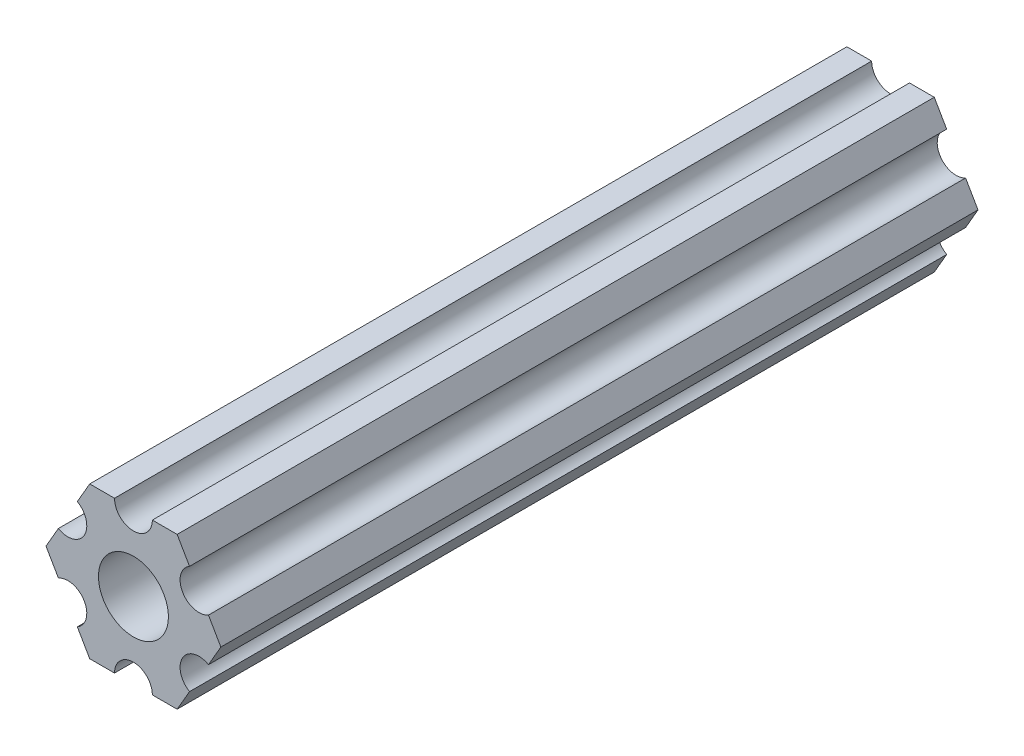
ISO-10303-21;
HEADER;
FILE_DESCRIPTION(('STEP AP214'),'2;1');
FILE_NAME('part.step','',(''),(''),'','','');
FILE_SCHEMA(('AUTOMOTIVE_DESIGN { 1 0 10303 214 1 1 1 1 }'));
ENDSEC;
DATA;
#1=APPLICATION_CONTEXT('core data for automotive mechanical design processes');
#2=APPLICATION_PROTOCOL_DEFINITION('international standard','automotive_design',2000,#1);
#3=PRODUCT_CONTEXT('',#1,'mechanical');
#4=PRODUCT('Part','Part','',(#3));
#5=PRODUCT_RELATED_PRODUCT_CATEGORY('part','',(#4));
#6=PRODUCT_DEFINITION_FORMATION('','',#4);
#7=PRODUCT_DEFINITION_CONTEXT('part definition',#1,'design');
#8=PRODUCT_DEFINITION('design','',#6,#7);
#9=PRODUCT_DEFINITION_SHAPE('','',#8);
#10=(LENGTH_UNIT() NAMED_UNIT(*) SI_UNIT(.MILLI.,.METRE.));
#11=(NAMED_UNIT(*) PLANE_ANGLE_UNIT() SI_UNIT($,.RADIAN.));
#12=(NAMED_UNIT(*) SI_UNIT($,.STERADIAN.) SOLID_ANGLE_UNIT());
#13=UNCERTAINTY_MEASURE_WITH_UNIT(LENGTH_MEASURE(1.E-05),#10,'distance_accuracy_value','');
#14=(GEOMETRIC_REPRESENTATION_CONTEXT(3) GLOBAL_UNCERTAINTY_ASSIGNED_CONTEXT((#13)) GLOBAL_UNIT_ASSIGNED_CONTEXT((#10,
#11,#12)) REPRESENTATION_CONTEXT('',''));
#15=CARTESIAN_POINT('',(0.,0.,0.));
#16=DIRECTION('',(0.,0.,1.));
#17=DIRECTION('',(1.,0.,0.));
#18=AXIS2_PLACEMENT_3D('',#15,#16,#17);
#19=CARTESIAN_POINT('',(6.29301120497139,1.80018505273894,63.5));
#20=DIRECTION('',(0.866025373493143,0.500000052466059,0.));
#21=DIRECTION('',(-0.500000052466059,0.866025373493143,0.));
#22=AXIS2_PLACEMENT_3D('',#19,#20,#21);
#23=PLANE('',#22);
#24=DIRECTION('',(0.500000052466059,-0.866025373493143,0.));
#25=VECTOR('',#24,1.);
#26=CARTESIAN_POINT('',(6.29301120497139,1.80018505273894,0.));
#27=LINE('',#26,#25);
#28=CARTESIAN_POINT('',(6.29301120497139,1.80018505273894,0.));
#29=VERTEX_POINT('',#28);
#30=CARTESIAN_POINT('',(7.33234841870827,4.44212519169686E-07,0.));
#31=VERTEX_POINT('',#30);
#32=EDGE_CURVE('E190',#29,#31,#27,.T.);
#33=ORIENTED_EDGE('',*,*,#32,.F.);
#34=DIRECTION('',(0.,0.,-1.));
#35=VECTOR('',#34,1.);
#36=CARTESIAN_POINT('',(6.29301120497139,1.80018505273894,63.5));
#37=LINE('',#36,#35);
#38=CARTESIAN_POINT('',(6.29301120497139,1.80018505273894,63.5));
#39=VERTEX_POINT('',#38);
#40=EDGE_CURVE('E11',#39,#29,#37,.T.);
#41=ORIENTED_EDGE('',*,*,#40,.F.);
#42=DIRECTION('',(0.500000052466059,-0.866025373493143,0.));
#43=VECTOR('',#42,1.);
#44=CARTESIAN_POINT('',(6.29301120497139,1.80018505273894,63.5));
#45=LINE('',#44,#43);
#46=CARTESIAN_POINT('',(7.33234841870827,4.44212519169686E-07,63.5));
#47=VERTEX_POINT('',#46);
#48=EDGE_CURVE('E241',#39,#47,#45,.T.);
#49=ORIENTED_EDGE('',*,*,#48,.T.);
#50=DIRECTION('',(0.,0.,-1.));
#51=VECTOR('',#50,1.);
#52=CARTESIAN_POINT('',(7.33234841870827,4.44212519169686E-07,63.5));
#53=LINE('',#52,#51);
#54=EDGE_CURVE('E36',#47,#31,#53,.T.);
#55=ORIENTED_EDGE('',*,*,#54,.T.);
#56=EDGE_LOOP('',(#33,#41,#49,#55));
#57=FACE_BOUND('',#56,.T.);
#58=ADVANCED_FACE('F33',(#57),#23,.T.);
#59=CARTESIAN_POINT('',(5.49926112168152,3.17500033315931,63.5));
#60=DIRECTION('',(0.,0.,-1.));
#61=DIRECTION('',(-1.,0.,0.));
#62=AXIS2_PLACEMENT_3D('',#59,#60,#61);
#63=CYLINDRICAL_SURFACE('',#62,1.5875);
#64=CARTESIAN_POINT('',(5.49926112168152,3.17500033315931,0.));
#65=DIRECTION('',(0.,0.,1.));
#66=DIRECTION('',(1.,0.,0.));
#67=AXIS2_PLACEMENT_3D('',#64,#65,#66);
#68=CIRCLE('',#67,1.5875);
#69=CARTESIAN_POINT('',(4.70551103839165,4.54981561357968,0.));
#70=VERTEX_POINT('',#69);
#71=EDGE_CURVE('E239',#70,#29,#68,.T.);
#72=ORIENTED_EDGE('',*,*,#71,.F.);
#73=DIRECTION('',(0.,0.,-1.));
#74=VECTOR('',#73,1.);
#75=CARTESIAN_POINT('',(4.70551103839165,4.54981561357968,63.5));
#76=LINE('',#75,#74);
#77=CARTESIAN_POINT('',(4.70551103839165,4.54981561357968,63.5));
#78=VERTEX_POINT('',#77);
#79=EDGE_CURVE('E42',#78,#70,#76,.T.);
#80=ORIENTED_EDGE('',*,*,#79,.F.);
#81=CARTESIAN_POINT('',(5.49926112168152,3.17500033315931,63.5));
#82=DIRECTION('',(0.,0.,1.));
#83=DIRECTION('',(1.,0.,0.));
#84=AXIS2_PLACEMENT_3D('',#81,#82,#83);
#85=CIRCLE('',#84,1.5875);
#86=EDGE_CURVE('E180',#78,#39,#85,.T.);
#87=ORIENTED_EDGE('',*,*,#86,.T.);
#88=ORIENTED_EDGE('',*,*,#40,.T.);
#89=EDGE_LOOP('',(#72,#80,#87,#88));
#90=FACE_BOUND('',#89,.T.);
#91=ADVANCED_FACE('F273',(#90),#63,.F.);
#92=CARTESIAN_POINT('',(3.66617382465471,6.35000022210621,63.5));
#93=DIRECTION('',(0.866025373493144,0.500000052466059,0.));
#94=DIRECTION('',(-0.500000052466059,0.866025373493144,0.));
#95=AXIS2_PLACEMENT_3D('',#92,#93,#94);
#96=PLANE('',#95);
#97=DIRECTION('',(0.500000052466059,-0.866025373493143,0.));
#98=VECTOR('',#97,1.);
#99=CARTESIAN_POINT('',(3.66617382465471,6.35000022210621,0.));
#100=LINE('',#99,#98);
#101=CARTESIAN_POINT('',(3.66617382465471,6.35000022210621,0.));
#102=VERTEX_POINT('',#101);
#103=EDGE_CURVE('E167',#102,#70,#100,.T.);
#104=ORIENTED_EDGE('',*,*,#103,.F.);
#105=DIRECTION('',(0.,0.,-1.));
#106=VECTOR('',#105,1.);
#107=CARTESIAN_POINT('',(3.66617382465471,6.35000022210621,63.5));
#108=LINE('',#107,#106);
#109=CARTESIAN_POINT('',(3.66617382465471,6.35000022210621,63.5));
#110=VERTEX_POINT('',#109);
#111=EDGE_CURVE('E162',#110,#102,#108,.T.);
#112=ORIENTED_EDGE('',*,*,#111,.F.);
#113=DIRECTION('',(0.500000052466059,-0.866025373493143,0.));
#114=VECTOR('',#113,1.);
#115=CARTESIAN_POINT('',(3.66617382465471,6.35000022210621,63.5));
#116=LINE('',#115,#114);
#117=EDGE_CURVE('E165',#110,#78,#116,.T.);
#118=ORIENTED_EDGE('',*,*,#117,.T.);
#119=ORIENTED_EDGE('',*,*,#79,.T.);
#120=EDGE_LOOP('',(#104,#112,#118,#119));
#121=FACE_BOUND('',#120,.T.);
#122=ADVANCED_FACE('F164',(#121),#96,.T.);
#123=CARTESIAN_POINT('',(1.58749961530064,6.35000022210621,63.5));
#124=DIRECTION('',(0.,1.,0.));
#125=DIRECTION('',(-1.,0.,0.));
#126=AXIS2_PLACEMENT_3D('',#123,#124,#125);
#127=PLANE('',#126);
#128=DIRECTION('',(1.,0.,0.));
#129=VECTOR('',#128,1.);
#130=CARTESIAN_POINT('',(1.58749961530064,6.35000022210621,0.));
#131=LINE('',#130,#129);
#132=CARTESIAN_POINT('',(1.58749961530064,6.35000022210621,0.));
#133=VERTEX_POINT('',#132);
#134=EDGE_CURVE('E236',#133,#102,#131,.T.);
#135=ORIENTED_EDGE('',*,*,#134,.F.);
#136=DIRECTION('',(0.,0.,-1.));
#137=VECTOR('',#136,1.);
#138=CARTESIAN_POINT('',(1.58749961530064,6.35000022210621,63.5));
#139=LINE('',#138,#137);
#140=CARTESIAN_POINT('',(1.58749961530064,6.35000022210621,63.5));
#141=VERTEX_POINT('',#140);
#142=EDGE_CURVE('E172',#141,#133,#139,.T.);
#143=ORIENTED_EDGE('',*,*,#142,.F.);
#144=DIRECTION('',(1.,0.,0.));
#145=VECTOR('',#144,1.);
#146=CARTESIAN_POINT('',(1.58749961530064,6.35000022210621,63.5));
#147=LINE('',#146,#145);
#148=EDGE_CURVE('E178',#141,#110,#147,.T.);
#149=ORIENTED_EDGE('',*,*,#148,.T.);
#150=ORIENTED_EDGE('',*,*,#111,.T.);
#151=EDGE_LOOP('',(#135,#143,#149,#150));
#152=FACE_BOUND('',#151,.T.);
#153=ADVANCED_FACE('F182',(#152),#127,.T.);
#154=CARTESIAN_POINT('',(-3.84699364247082E-07,6.35000022210621,63.5));
#155=DIRECTION('',(0.,0.,-1.));
#156=DIRECTION('',(-1.,0.,0.));
#157=AXIS2_PLACEMENT_3D('',#154,#155,#156);
#158=CYLINDRICAL_SURFACE('',#157,1.5875);
#159=CARTESIAN_POINT('',(-3.84699364247082E-07,6.35000022210621,0.));
#160=DIRECTION('',(0.,0.,1.));
#161=DIRECTION('',(1.,0.,0.));
#162=AXIS2_PLACEMENT_3D('',#159,#160,#161);
#163=CIRCLE('',#162,1.5875);
#164=CARTESIAN_POINT('',(-1.58750038469937,6.35000022210621,0.));
#165=VERTEX_POINT('',#164);
#166=EDGE_CURVE('E233',#165,#133,#163,.T.);
#167=ORIENTED_EDGE('',*,*,#166,.F.);
#168=DIRECTION('',(0.,0.,-1.));
#169=VECTOR('',#168,1.);
#170=CARTESIAN_POINT('',(-1.58750038469937,6.35000022210621,63.5));
#171=LINE('',#170,#169);
#172=CARTESIAN_POINT('',(-1.58750038469937,6.35000022210621,63.5));
#173=VERTEX_POINT('',#172);
#174=EDGE_CURVE('E245',#173,#165,#171,.T.);
#175=ORIENTED_EDGE('',*,*,#174,.F.);
#176=CARTESIAN_POINT('',(-3.84699364247082E-07,6.35000022210621,63.5));
#177=DIRECTION('',(0.,0.,1.));
#178=DIRECTION('',(1.,0.,0.));
#179=AXIS2_PLACEMENT_3D('',#176,#177,#178);
#180=CIRCLE('',#179,1.5875);
#181=EDGE_CURVE('E183',#173,#141,#180,.T.);
#182=ORIENTED_EDGE('',*,*,#181,.T.);
#183=ORIENTED_EDGE('',*,*,#142,.T.);
#184=EDGE_LOOP('',(#167,#175,#182,#183));
#185=FACE_BOUND('',#184,.T.);
#186=ADVANCED_FACE('F286',(#185),#158,.F.);
#187=CARTESIAN_POINT('',(-3.6661745940536,6.35000022210621,63.5));
#188=DIRECTION('',(0.,1.,0.));
#189=DIRECTION('',(-1.,0.,0.));
#190=AXIS2_PLACEMENT_3D('',#187,#188,#189);
#191=PLANE('',#190);
#192=DIRECTION('',(1.,0.,0.));
#193=VECTOR('',#192,1.);
#194=CARTESIAN_POINT('',(-3.6661745940536,6.35000022210621,0.));
#195=LINE('',#194,#193);
#196=CARTESIAN_POINT('',(-3.6661745940536,6.35000022210621,0.));
#197=VERTEX_POINT('',#196);
#198=EDGE_CURVE('E230',#197,#165,#195,.T.);
#199=ORIENTED_EDGE('',*,*,#198,.F.);
#200=DIRECTION('',(0.,0.,-1.));
#201=VECTOR('',#200,1.);
#202=CARTESIAN_POINT('',(-3.6661745940536,6.35000022210621,63.5));
#203=LINE('',#202,#201);
#204=CARTESIAN_POINT('',(-3.6661745940536,6.35000022210621,63.5));
#205=VERTEX_POINT('',#204);
#206=EDGE_CURVE('E247',#205,#197,#203,.T.);
#207=ORIENTED_EDGE('',*,*,#206,.F.);
#208=DIRECTION('',(1.,0.,0.));
#209=VECTOR('',#208,1.);
#210=CARTESIAN_POINT('',(-3.6661745940536,6.35000022210621,63.5));
#211=LINE('',#210,#209);
#212=EDGE_CURVE('E185',#205,#173,#211,.T.);
#213=ORIENTED_EDGE('',*,*,#212,.T.);
#214=ORIENTED_EDGE('',*,*,#174,.T.);
#215=EDGE_LOOP('',(#199,#207,#213,#214));
#216=FACE_BOUND('',#215,.T.);
#217=ADVANCED_FACE('F289',(#216),#191,.T.);
#218=CARTESIAN_POINT('',(-4.70551143896598,4.5498156227453,63.5));
#219=DIRECTION('',(-0.866025449221372,0.499999921300914,0.));
#220=DIRECTION('',(-0.499999921300914,-0.866025449221372,0.));
#221=AXIS2_PLACEMENT_3D('',#218,#219,#220);
#222=PLANE('',#221);
#223=DIRECTION('',(0.499999921300914,0.866025449221372,0.));
#224=VECTOR('',#223,1.);
#225=CARTESIAN_POINT('',(-4.70551143896598,4.5498156227453,0.));
#226=LINE('',#225,#224);
#227=CARTESIAN_POINT('',(-4.70551143896598,4.5498156227453,0.));
#228=VERTEX_POINT('',#227);
#229=EDGE_CURVE('E227',#228,#197,#226,.T.);
#230=ORIENTED_EDGE('',*,*,#229,.F.);
#231=DIRECTION('',(0.,0.,-1.));
#232=VECTOR('',#231,1.);
#233=CARTESIAN_POINT('',(-4.70551143896598,4.5498156227453,63.5));
#234=LINE('',#233,#232);
#235=CARTESIAN_POINT('',(-4.70551143896598,4.5498156227453,63.5));
#236=VERTEX_POINT('',#235);
#237=EDGE_CURVE('E249',#236,#228,#234,.T.);
#238=ORIENTED_EDGE('',*,*,#237,.F.);
#239=DIRECTION('',(0.499999921300914,0.866025449221372,0.));
#240=VECTOR('',#239,1.);
#241=CARTESIAN_POINT('',(-4.70551143896598,4.5498156227453,63.5));
#242=LINE('',#241,#240);
#243=EDGE_CURVE('E394',#236,#205,#242,.T.);
#244=ORIENTED_EDGE('',*,*,#243,.T.);
#245=ORIENTED_EDGE('',*,*,#206,.T.);
#246=EDGE_LOOP('',(#230,#238,#244,#245));
#247=FACE_BOUND('',#246,.T.);
#248=ADVANCED_FACE('F293',(#247),#222,.T.);
#249=CARTESIAN_POINT('',(-5.49926131403118,3.17500022210637,63.5));
#250=DIRECTION('',(0.,0.,-1.));
#251=DIRECTION('',(-1.,0.,0.));
#252=AXIS2_PLACEMENT_3D('',#249,#250,#251);
#253=CYLINDRICAL_SURFACE('',#252,1.5875);
#254=CARTESIAN_POINT('',(-5.49926131403118,3.17500022210637,0.));
#255=DIRECTION('',(0.,0.,1.));
#256=DIRECTION('',(1.,0.,0.));
#257=AXIS2_PLACEMENT_3D('',#254,#255,#256);
#258=CIRCLE('',#257,1.5875);
#259=CARTESIAN_POINT('',(-6.29301118909638,1.80018482146744,0.));
#260=VERTEX_POINT('',#259);
#261=EDGE_CURVE('E224',#260,#228,#258,.T.);
#262=ORIENTED_EDGE('',*,*,#261,.F.);
#263=DIRECTION('',(0.,0.,-1.));
#264=VECTOR('',#263,1.);
#265=CARTESIAN_POINT('',(-6.29301118909638,1.80018482146744,63.5));
#266=LINE('',#265,#264);
#267=CARTESIAN_POINT('',(-6.29301118909638,1.80018482146744,63.5));
#268=VERTEX_POINT('',#267);
#269=EDGE_CURVE('E251',#268,#260,#266,.T.);
#270=ORIENTED_EDGE('',*,*,#269,.F.);
#271=CARTESIAN_POINT('',(-5.49926131403118,3.17500022210637,63.5));
#272=DIRECTION('',(0.,0.,1.));
#273=DIRECTION('',(1.,0.,0.));
#274=AXIS2_PLACEMENT_3D('',#271,#272,#273);
#275=CIRCLE('',#274,1.5875);
#276=EDGE_CURVE('E391',#268,#236,#275,.T.);
#277=ORIENTED_EDGE('',*,*,#276,.T.);
#278=ORIENTED_EDGE('',*,*,#237,.T.);
#279=EDGE_LOOP('',(#262,#270,#277,#278));
#280=FACE_BOUND('',#279,.T.);
#281=ADVANCED_FACE('F297',(#280),#253,.F.);
#282=CARTESIAN_POINT('',(-7.33234803400887,2.22106353521304E-07,63.5));
#283=DIRECTION('',(-0.866025449221373,0.499999921300913,0.));
#284=DIRECTION('',(-0.499999921300913,-0.866025449221373,0.));
#285=AXIS2_PLACEMENT_3D('',#282,#283,#284);
#286=PLANE('',#285);
#287=DIRECTION('',(0.499999921300913,0.866025449221373,0.));
#288=VECTOR('',#287,1.);
#289=CARTESIAN_POINT('',(-7.33234803400887,2.22106353521304E-07,0.));
#290=LINE('',#289,#288);
#291=CARTESIAN_POINT('',(-7.33234803400887,2.22106353521304E-07,0.));
#292=VERTEX_POINT('',#291);
#293=EDGE_CURVE('E221',#292,#260,#290,.T.);
#294=ORIENTED_EDGE('',*,*,#293,.F.);
#295=DIRECTION('',(0.,0.,-1.));
#296=VECTOR('',#295,1.);
#297=CARTESIAN_POINT('',(-7.33234803400887,2.22106353521304E-07,63.5));
#298=LINE('',#297,#296);
#299=CARTESIAN_POINT('',(-7.33234803400887,2.22106353521304E-07,63.5));
#300=VERTEX_POINT('',#299);
#301=EDGE_CURVE('E253',#300,#292,#298,.T.);
#302=ORIENTED_EDGE('',*,*,#301,.F.);
#303=DIRECTION('',(0.499999921300913,0.866025449221373,0.));
#304=VECTOR('',#303,1.);
#305=CARTESIAN_POINT('',(-7.33234803400887,2.22106353521304E-07,63.5));
#306=LINE('',#305,#304);
#307=EDGE_CURVE('E388',#300,#268,#306,.T.);
#308=ORIENTED_EDGE('',*,*,#307,.T.);
#309=ORIENTED_EDGE('',*,*,#269,.T.);
#310=EDGE_LOOP('',(#294,#302,#308,#309));
#311=FACE_BOUND('',#310,.T.);
#312=ADVANCED_FACE('F301',(#311),#286,.T.);
#313=CARTESIAN_POINT('',(-6.29301092933186,-1.80018444938582,63.5));
#314=DIRECTION('',(-0.866025403784447,-0.499999999999985,0.));
#315=DIRECTION('',(0.499999999999985,-0.866025403784447,0.));
#316=AXIS2_PLACEMENT_3D('',#313,#314,#315);
#317=PLANE('',#316);
#318=DIRECTION('',(-0.499999999999985,0.866025403784447,0.));
#319=VECTOR('',#318,1.);
#320=CARTESIAN_POINT('',(-6.29301092933186,-1.80018444938582,0.));
#321=LINE('',#320,#319);
#322=CARTESIAN_POINT('',(-6.29301092933186,-1.80018444938582,0.));
#323=VERTEX_POINT('',#322);
#324=EDGE_CURVE('E218',#323,#292,#321,.T.);
#325=ORIENTED_EDGE('',*,*,#324,.F.);
#326=DIRECTION('',(0.,0.,-1.));
#327=VECTOR('',#326,1.);
#328=CARTESIAN_POINT('',(-6.29301092933186,-1.80018444938582,63.5));
#329=LINE('',#328,#327);
#330=CARTESIAN_POINT('',(-6.29301092933186,-1.80018444938582,63.5));
#331=VERTEX_POINT('',#330);
#332=EDGE_CURVE('E255',#331,#323,#329,.T.);
#333=ORIENTED_EDGE('',*,*,#332,.F.);
#334=DIRECTION('',(-0.499999999999985,0.866025403784447,0.));
#335=VECTOR('',#334,1.);
#336=CARTESIAN_POINT('',(-6.29301092933186,-1.80018444938582,63.5));
#337=LINE('',#336,#335);
#338=EDGE_CURVE('E385',#331,#300,#337,.T.);
#339=ORIENTED_EDGE('',*,*,#338,.T.);
#340=ORIENTED_EDGE('',*,*,#301,.T.);
#341=EDGE_LOOP('',(#325,#333,#339,#340));
#342=FACE_BOUND('',#341,.T.);
#343=ADVANCED_FACE('F305',(#342),#317,.T.);
#344=CARTESIAN_POINT('',(-5.49926092933189,-3.17499977789363,63.5));
#345=DIRECTION('',(0.,0.,-1.));
#346=DIRECTION('',(-1.,0.,0.));
#347=AXIS2_PLACEMENT_3D('',#344,#345,#346);
#348=CYLINDRICAL_SURFACE('',#347,1.5875);
#349=CARTESIAN_POINT('',(-5.49926092933189,-3.17499977789363,0.));
#350=DIRECTION('',(0.,0.,1.));
#351=DIRECTION('',(1.,0.,0.));
#352=AXIS2_PLACEMENT_3D('',#349,#350,#351);
#353=CIRCLE('',#352,1.5875);
#354=CARTESIAN_POINT('',(-4.70551092933191,-4.54981510640144,0.));
#355=VERTEX_POINT('',#354);
#356=EDGE_CURVE('E215',#355,#323,#353,.T.);
#357=ORIENTED_EDGE('',*,*,#356,.F.);
#358=DIRECTION('',(0.,0.,-1.));
#359=VECTOR('',#358,1.);
#360=CARTESIAN_POINT('',(-4.70551092933191,-4.54981510640144,63.5));
#361=LINE('',#360,#359);
#362=CARTESIAN_POINT('',(-4.70551092933191,-4.54981510640144,63.5));
#363=VERTEX_POINT('',#362);
#364=EDGE_CURVE('E257',#363,#355,#361,.T.);
#365=ORIENTED_EDGE('',*,*,#364,.F.);
#366=CARTESIAN_POINT('',(-5.49926092933189,-3.17499977789363,63.5));
#367=DIRECTION('',(0.,0.,1.));
#368=DIRECTION('',(1.,0.,0.));
#369=AXIS2_PLACEMENT_3D('',#366,#367,#368);
#370=CIRCLE('',#369,1.5875);
#371=EDGE_CURVE('E382',#363,#331,#370,.T.);
#372=ORIENTED_EDGE('',*,*,#371,.T.);
#373=ORIENTED_EDGE('',*,*,#332,.T.);
#374=EDGE_LOOP('',(#357,#365,#372,#373));
#375=FACE_BOUND('',#374,.T.);
#376=ADVANCED_FACE('F309',(#375),#348,.F.);
#377=CARTESIAN_POINT('',(-3.66617382465484,-6.34999977789374,63.5));
#378=DIRECTION('',(-0.866025403784447,-0.499999999999985,0.));
#379=DIRECTION('',(0.499999999999985,-0.866025403784447,0.));
#380=AXIS2_PLACEMENT_3D('',#377,#378,#379);
#381=PLANE('',#380);
#382=DIRECTION('',(-0.499999999999985,0.866025403784447,0.));
#383=VECTOR('',#382,1.);
#384=CARTESIAN_POINT('',(-3.66617382465484,-6.34999977789374,0.));
#385=LINE('',#384,#383);
#386=CARTESIAN_POINT('',(-3.66617382465484,-6.34999977789374,0.));
#387=VERTEX_POINT('',#386);
#388=EDGE_CURVE('E212',#387,#355,#385,.T.);
#389=ORIENTED_EDGE('',*,*,#388,.F.);
#390=DIRECTION('',(0.,0.,-1.));
#391=VECTOR('',#390,1.);
#392=CARTESIAN_POINT('',(-3.66617382465484,-6.34999977789374,63.5));
#393=LINE('',#392,#391);
#394=CARTESIAN_POINT('',(-3.66617382465484,-6.34999977789374,63.5));
#395=VERTEX_POINT('',#394);
#396=EDGE_CURVE('E259',#395,#387,#393,.T.);
#397=ORIENTED_EDGE('',*,*,#396,.F.);
#398=DIRECTION('',(-0.499999999999985,0.866025403784447,0.));
#399=VECTOR('',#398,1.);
#400=CARTESIAN_POINT('',(-3.66617382465484,-6.34999977789374,63.5));
#401=LINE('',#400,#399);
#402=EDGE_CURVE('E379',#395,#363,#401,.T.);
#403=ORIENTED_EDGE('',*,*,#402,.T.);
#404=ORIENTED_EDGE('',*,*,#364,.T.);
#405=EDGE_LOOP('',(#389,#397,#403,#404));
#406=FACE_BOUND('',#405,.T.);
#407=ADVANCED_FACE('F313',(#406),#381,.T.);
#408=CARTESIAN_POINT('',(-1.58749961530076,-6.34999977789374,63.5));
#409=DIRECTION('',(0.,-1.,0.));
#410=DIRECTION('',(0.,0.,-1.));
#411=AXIS2_PLACEMENT_3D('',#408,#409,#410);
#412=PLANE('',#411);
#413=DIRECTION('',(-1.,0.,0.));
#414=VECTOR('',#413,1.);
#415=CARTESIAN_POINT('',(-1.58749961530076,-6.34999977789374,0.));
#416=LINE('',#415,#414);
#417=CARTESIAN_POINT('',(-1.58749961530076,-6.34999977789374,0.));
#418=VERTEX_POINT('',#417);
#419=EDGE_CURVE('E209',#418,#387,#416,.T.);
#420=ORIENTED_EDGE('',*,*,#419,.F.);
#421=DIRECTION('',(0.,0.,-1.));
#422=VECTOR('',#421,1.);
#423=CARTESIAN_POINT('',(-1.58749961530076,-6.34999977789374,63.5));
#424=LINE('',#423,#422);
#425=CARTESIAN_POINT('',(-1.58749961530076,-6.34999977789374,63.5));
#426=VERTEX_POINT('',#425);
#427=EDGE_CURVE('E261',#426,#418,#424,.T.);
#428=ORIENTED_EDGE('',*,*,#427,.F.);
#429=DIRECTION('',(-1.,0.,0.));
#430=VECTOR('',#429,1.);
#431=CARTESIAN_POINT('',(-1.58749961530076,-6.34999977789374,63.5));
#432=LINE('',#431,#430);
#433=EDGE_CURVE('E376',#426,#395,#432,.T.);
#434=ORIENTED_EDGE('',*,*,#433,.T.);
#435=ORIENTED_EDGE('',*,*,#396,.T.);
#436=EDGE_LOOP('',(#420,#428,#434,#435));
#437=FACE_BOUND('',#436,.T.);
#438=ADVANCED_FACE('F317',(#437),#412,.T.);
#439=CARTESIAN_POINT('',(3.84699238071025E-07,-6.34999977789374,63.5));
#440=DIRECTION('',(0.,0.,-1.));
#441=DIRECTION('',(-1.,0.,0.));
#442=AXIS2_PLACEMENT_3D('',#439,#440,#441);
#443=CYLINDRICAL_SURFACE('',#442,1.5875);
#444=CARTESIAN_POINT('',(3.84699238071025E-07,-6.34999977789374,0.));
#445=DIRECTION('',(0.,0.,1.));
#446=DIRECTION('',(1.,0.,0.));
#447=AXIS2_PLACEMENT_3D('',#444,#445,#446);
#448=CIRCLE('',#447,1.5875);
#449=CARTESIAN_POINT('',(1.58750038469924,-6.34999977789374,0.));
#450=VERTEX_POINT('',#449);
#451=EDGE_CURVE('E206',#450,#418,#448,.T.);
#452=ORIENTED_EDGE('',*,*,#451,.F.);
#453=DIRECTION('',(0.,0.,-1.));
#454=VECTOR('',#453,1.);
#455=CARTESIAN_POINT('',(1.58750038469924,-6.34999977789374,63.5));
#456=LINE('',#455,#454);
#457=CARTESIAN_POINT('',(1.58750038469924,-6.34999977789374,63.5));
#458=VERTEX_POINT('',#457);
#459=EDGE_CURVE('E263',#458,#450,#456,.T.);
#460=ORIENTED_EDGE('',*,*,#459,.F.);
#461=CARTESIAN_POINT('',(3.84699238071025E-07,-6.34999977789374,63.5));
#462=DIRECTION('',(0.,0.,1.));
#463=DIRECTION('',(1.,0.,0.));
#464=AXIS2_PLACEMENT_3D('',#461,#462,#463);
#465=CIRCLE('',#464,1.5875);
#466=EDGE_CURVE('E373',#458,#426,#465,.T.);
#467=ORIENTED_EDGE('',*,*,#466,.T.);
#468=ORIENTED_EDGE('',*,*,#427,.T.);
#469=EDGE_LOOP('',(#452,#460,#467,#468));
#470=FACE_BOUND('',#469,.T.);
#471=ADVANCED_FACE('F321',(#470),#443,.F.);
#472=CARTESIAN_POINT('',(3.66617459405344,-6.34999977789374,63.5));
#473=DIRECTION('',(0.,-1.,0.));
#474=DIRECTION('',(0.,0.,-1.));
#475=AXIS2_PLACEMENT_3D('',#472,#473,#474);
#476=PLANE('',#475);
#477=DIRECTION('',(-1.,0.,0.));
#478=VECTOR('',#477,1.);
#479=CARTESIAN_POINT('',(3.66617459405344,-6.34999977789374,0.));
#480=LINE('',#479,#478);
#481=CARTESIAN_POINT('',(3.66617459405344,-6.34999977789374,0.));
#482=VERTEX_POINT('',#481);
#483=EDGE_CURVE('E203',#482,#450,#480,.T.);
#484=ORIENTED_EDGE('',*,*,#483,.F.);
#485=DIRECTION('',(0.,0.,-1.));
#486=VECTOR('',#485,1.);
#487=CARTESIAN_POINT('',(3.66617459405344,-6.34999977789374,63.5));
#488=LINE('',#487,#486);
#489=CARTESIAN_POINT('',(3.66617459405344,-6.34999977789374,63.5));
#490=VERTEX_POINT('',#489);
#491=EDGE_CURVE('E265',#490,#482,#488,.T.);
#492=ORIENTED_EDGE('',*,*,#491,.F.);
#493=DIRECTION('',(-1.,0.,0.));
#494=VECTOR('',#493,1.);
#495=CARTESIAN_POINT('',(3.66617459405344,-6.34999977789374,63.5));
#496=LINE('',#495,#494);
#497=EDGE_CURVE('E370',#490,#458,#496,.T.);
#498=ORIENTED_EDGE('',*,*,#497,.T.);
#499=ORIENTED_EDGE('',*,*,#459,.T.);
#500=EDGE_LOOP('',(#484,#492,#498,#499));
#501=FACE_BOUND('',#500,.T.);
#502=ADVANCED_FACE('F325',(#501),#476,.T.);
#503=CARTESIAN_POINT('',(4.70551158967066,-4.54981504343588,63.5));
#504=DIRECTION('',(0.866025434075721,-0.499999947533957,0.));
#505=DIRECTION('',(0.499999947533957,0.866025434075721,0.));
#506=AXIS2_PLACEMENT_3D('',#503,#504,#505);
#507=PLANE('',#506);
#508=DIRECTION('',(-0.499999947533957,-0.866025434075721,0.));
#509=VECTOR('',#508,1.);
#510=CARTESIAN_POINT('',(4.70551158967066,-4.54981504343588,0.));
#511=LINE('',#510,#509);
#512=CARTESIAN_POINT('',(4.70551158967066,-4.54981504343588,0.));
#513=VERTEX_POINT('',#512);
#514=EDGE_CURVE('E200',#513,#482,#511,.T.);
#515=ORIENTED_EDGE('',*,*,#514,.F.);
#516=DIRECTION('',(0.,0.,-1.));
#517=VECTOR('',#516,1.);
#518=CARTESIAN_POINT('',(4.70551158967066,-4.54981504343588,63.5));
#519=LINE('',#518,#517);
#520=CARTESIAN_POINT('',(4.70551158967066,-4.54981504343588,63.5));
#521=VERTEX_POINT('',#520);
#522=EDGE_CURVE('E267',#521,#513,#519,.T.);
#523=ORIENTED_EDGE('',*,*,#522,.F.);
#524=DIRECTION('',(-0.499999947533957,-0.866025434075721,0.));
#525=VECTOR('',#524,1.);
#526=CARTESIAN_POINT('',(4.70551158967066,-4.54981504343588,63.5));
#527=LINE('',#526,#525);
#528=EDGE_CURVE('E367',#521,#490,#527,.T.);
#529=ORIENTED_EDGE('',*,*,#528,.T.);
#530=ORIENTED_EDGE('',*,*,#491,.T.);
#531=EDGE_LOOP('',(#515,#523,#529,#530));
#532=FACE_BOUND('',#531,.T.);
#533=ADVANCED_FACE('F329',(#532),#507,.T.);
#534=CARTESIAN_POINT('',(5.49926150638082,-3.17499966684067,63.5));
#535=DIRECTION('',(0.,0.,-1.));
#536=DIRECTION('',(-1.,0.,0.));
#537=AXIS2_PLACEMENT_3D('',#534,#535,#536);
#538=CYLINDRICAL_SURFACE('',#537,1.5875);
#539=CARTESIAN_POINT('',(5.49926150638082,-3.17499966684067,0.));
#540=DIRECTION('',(0.,0.,1.));
#541=DIRECTION('',(1.,0.,0.));
#542=AXIS2_PLACEMENT_3D('',#539,#540,#541);
#543=CIRCLE('',#542,1.5875);
#544=CARTESIAN_POINT('',(6.29301142309098,-1.80018429024546,0.));
#545=VERTEX_POINT('',#544);
#546=EDGE_CURVE('E197',#545,#513,#543,.T.);
#547=ORIENTED_EDGE('',*,*,#546,.F.);
#548=DIRECTION('',(0.,0.,-1.));
#549=VECTOR('',#548,1.);
#550=CARTESIAN_POINT('',(6.29301142309098,-1.80018429024546,63.5));
#551=LINE('',#550,#549);
#552=CARTESIAN_POINT('',(6.29301142309098,-1.80018429024546,63.5));
#553=VERTEX_POINT('',#552);
#554=EDGE_CURVE('E268',#553,#545,#551,.T.);
#555=ORIENTED_EDGE('',*,*,#554,.F.);
#556=CARTESIAN_POINT('',(5.49926150638082,-3.17499966684067,63.5));
#557=DIRECTION('',(0.,0.,1.));
#558=DIRECTION('',(1.,0.,0.));
#559=AXIS2_PLACEMENT_3D('',#556,#557,#558);
#560=CIRCLE('',#559,1.5875);
#561=EDGE_CURVE('E364',#553,#521,#560,.T.);
#562=ORIENTED_EDGE('',*,*,#561,.T.);
#563=ORIENTED_EDGE('',*,*,#522,.T.);
#564=EDGE_LOOP('',(#547,#555,#562,#563));
#565=FACE_BOUND('',#564,.T.);
#566=ADVANCED_FACE('F333',(#565),#538,.F.);
#567=CARTESIAN_POINT('',(7.33234841870827,4.44212519169686E-07,63.5));
#568=DIRECTION('',(0.866025434075721,-0.499999947533957,0.));
#569=DIRECTION('',(0.499999947533957,0.866025434075721,0.));
#570=AXIS2_PLACEMENT_3D('',#567,#568,#569);
#571=PLANE('',#570);
#572=DIRECTION('',(-0.499999947533957,-0.866025434075721,0.));
#573=VECTOR('',#572,1.);
#574=CARTESIAN_POINT('',(7.33234841870827,4.44212519169686E-07,0.));
#575=LINE('',#574,#573);
#576=EDGE_CURVE('E193',#31,#545,#575,.T.);
#577=ORIENTED_EDGE('',*,*,#576,.F.);
#578=ORIENTED_EDGE('',*,*,#54,.F.);
#579=DIRECTION('',(-0.499999947533957,-0.866025434075721,0.));
#580=VECTOR('',#579,1.);
#581=CARTESIAN_POINT('',(7.33234841870827,4.44212519169686E-07,63.5));
#582=LINE('',#581,#580);
#583=EDGE_CURVE('E362',#47,#553,#582,.T.);
#584=ORIENTED_EDGE('',*,*,#583,.T.);
#585=ORIENTED_EDGE('',*,*,#554,.T.);
#586=EDGE_LOOP('',(#577,#578,#584,#585));
#587=FACE_BOUND('',#586,.T.);
#588=ADVANCED_FACE('F270',(#587),#571,.T.);
#589=CARTESIAN_POINT('',(5.49926150638082,-3.17499966684067,63.5));
#590=DIRECTION('',(0.,0.,1.));
#591=DIRECTION('',(1.,0.,0.));
#592=AXIS2_PLACEMENT_3D('',#589,#590,#591);
#593=PLANE('',#592);
#594=CARTESIAN_POINT('',(0.,0.,63.5));
#595=DIRECTION('',(0.,0.,-1.));
#596=DIRECTION('',(1.,0.,0.));
#597=AXIS2_PLACEMENT_3D('',#594,#595,#596);
#598=CIRCLE('',#597,2.9337);
#599=CARTESIAN_POINT('',(2.9337,0.,63.5));
#600=VERTEX_POINT('',#599);
#601=EDGE_CURVE('E194',#600,#600,#598,.T.);
#602=ORIENTED_EDGE('',*,*,#601,.T.);
#603=EDGE_LOOP('',(#602));
#604=FACE_BOUND('',#603,.T.);
#605=ORIENTED_EDGE('',*,*,#48,.F.);
#606=ORIENTED_EDGE('',*,*,#86,.F.);
#607=ORIENTED_EDGE('',*,*,#117,.F.);
#608=ORIENTED_EDGE('',*,*,#148,.F.);
#609=ORIENTED_EDGE('',*,*,#181,.F.);
#610=ORIENTED_EDGE('',*,*,#212,.F.);
#611=ORIENTED_EDGE('',*,*,#243,.F.);
#612=ORIENTED_EDGE('',*,*,#276,.F.);
#613=ORIENTED_EDGE('',*,*,#307,.F.);
#614=ORIENTED_EDGE('',*,*,#338,.F.);
#615=ORIENTED_EDGE('',*,*,#371,.F.);
#616=ORIENTED_EDGE('',*,*,#402,.F.);
#617=ORIENTED_EDGE('',*,*,#433,.F.);
#618=ORIENTED_EDGE('',*,*,#466,.F.);
#619=ORIENTED_EDGE('',*,*,#497,.F.);
#620=ORIENTED_EDGE('',*,*,#528,.F.);
#621=ORIENTED_EDGE('',*,*,#561,.F.);
#622=ORIENTED_EDGE('',*,*,#583,.F.);
#623=EDGE_LOOP('',(#605,#606,#607,#608,#609,#610,#611,#612,#613,#614,#615,#616,#617,#618,#619,
#620,#621,#622));
#624=FACE_BOUND('',#623,.T.);
#625=ADVANCED_FACE('F176',(#604,#624),#593,.T.);
#626=CARTESIAN_POINT('',(5.49926150638082,-3.17499966684067,0.));
#627=DIRECTION('',(0.,0.,1.));
#628=DIRECTION('',(1.,0.,0.));
#629=AXIS2_PLACEMENT_3D('',#626,#627,#628);
#630=PLANE('',#629);
#631=CARTESIAN_POINT('',(0.,0.,0.));
#632=DIRECTION('',(0.,0.,-1.));
#633=DIRECTION('',(1.,0.,0.));
#634=AXIS2_PLACEMENT_3D('',#631,#632,#633);
#635=CIRCLE('',#634,2.9337);
#636=CARTESIAN_POINT('',(2.9337,0.,0.));
#637=VERTEX_POINT('',#636);
#638=EDGE_CURVE('E357',#637,#637,#635,.T.);
#639=ORIENTED_EDGE('',*,*,#638,.F.);
#640=EDGE_LOOP('',(#639));
#641=FACE_BOUND('',#640,.T.);
#642=ORIENTED_EDGE('',*,*,#32,.T.);
#643=ORIENTED_EDGE('',*,*,#576,.T.);
#644=ORIENTED_EDGE('',*,*,#546,.T.);
#645=ORIENTED_EDGE('',*,*,#514,.T.);
#646=ORIENTED_EDGE('',*,*,#483,.T.);
#647=ORIENTED_EDGE('',*,*,#451,.T.);
#648=ORIENTED_EDGE('',*,*,#419,.T.);
#649=ORIENTED_EDGE('',*,*,#388,.T.);
#650=ORIENTED_EDGE('',*,*,#356,.T.);
#651=ORIENTED_EDGE('',*,*,#324,.T.);
#652=ORIENTED_EDGE('',*,*,#293,.T.);
#653=ORIENTED_EDGE('',*,*,#261,.T.);
#654=ORIENTED_EDGE('',*,*,#229,.T.);
#655=ORIENTED_EDGE('',*,*,#198,.T.);
#656=ORIENTED_EDGE('',*,*,#166,.T.);
#657=ORIENTED_EDGE('',*,*,#134,.T.);
#658=ORIENTED_EDGE('',*,*,#103,.T.);
#659=ORIENTED_EDGE('',*,*,#71,.T.);
#660=EDGE_LOOP('',(#642,#643,#644,#645,#646,#647,#648,#649,#650,#651,#652,#653,#654,#655,#656,
#657,#658,#659));
#661=FACE_BOUND('',#660,.T.);
#662=ADVANCED_FACE('F272',(#641,#661),#630,.F.);
#663=CARTESIAN_POINT('',(0.,0.,63.5));
#664=DIRECTION('',(0.,0.,-1.));
#665=DIRECTION('',(-1.,0.,0.));
#666=AXIS2_PLACEMENT_3D('',#663,#664,#665);
#667=CYLINDRICAL_SURFACE('',#666,2.9337);
#668=ORIENTED_EDGE('',*,*,#601,.F.);
#669=EDGE_LOOP('',(#668));
#670=FACE_BOUND('',#669,.T.);
#671=ORIENTED_EDGE('',*,*,#638,.T.);
#672=EDGE_LOOP('',(#671));
#673=FACE_BOUND('',#672,.T.);
#674=ADVANCED_FACE('F345',(#670,#673),#667,.F.);
#675=CLOSED_SHELL('',(#58,#91,#122,#153,#186,#217,#248,#281,#312,#343,#376,#407,#438,#471,#502,
#533,#566,#588,#625,#662,#674));
#676=MANIFOLD_SOLID_BREP('B2',#675);
#677=ADVANCED_BREP_SHAPE_REPRESENTATION('',(#18,#676),#14);
#678=SHAPE_DEFINITION_REPRESENTATION(#9,#677);
ENDSEC;
END-ISO-10303-21;
